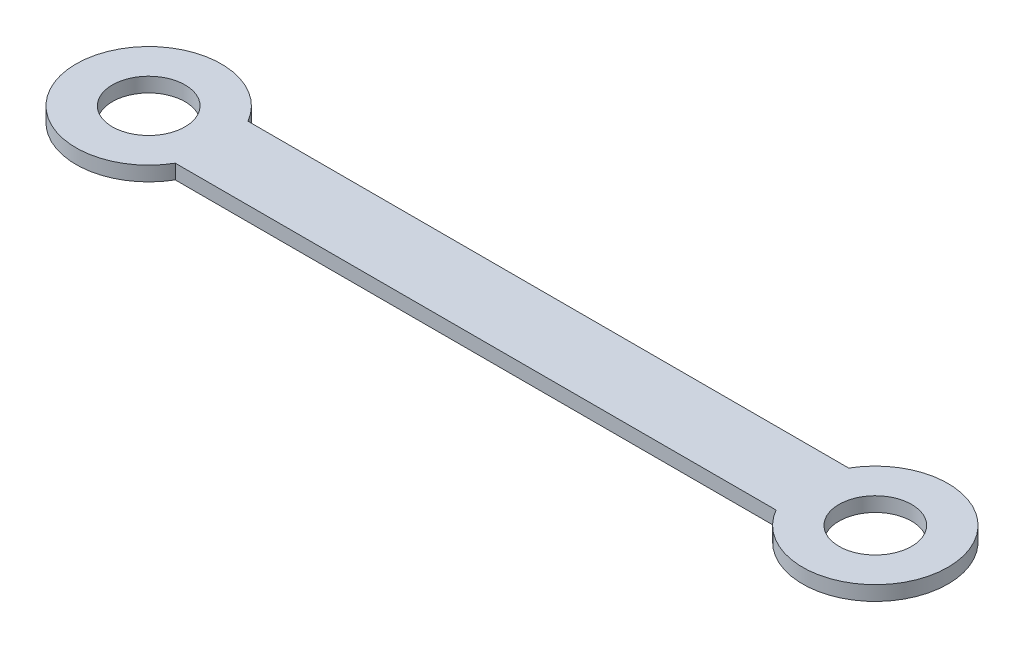
ISO-10303-21;
HEADER;
FILE_DESCRIPTION(('STEP AP214'),'2;1');
FILE_NAME('part.step','',(''),(''),'','','');
FILE_SCHEMA(('AUTOMOTIVE_DESIGN { 1 0 10303 214 1 1 1 1 }'));
ENDSEC;
DATA;
#1=APPLICATION_CONTEXT('core data for automotive mechanical design processes');
#2=APPLICATION_PROTOCOL_DEFINITION('international standard','automotive_design',2000,#1);
#3=PRODUCT_CONTEXT('',#1,'mechanical');
#4=PRODUCT('Part','Part','',(#3));
#5=PRODUCT_RELATED_PRODUCT_CATEGORY('part','',(#4));
#6=PRODUCT_DEFINITION_FORMATION('','',#4);
#7=PRODUCT_DEFINITION_CONTEXT('part definition',#1,'design');
#8=PRODUCT_DEFINITION('design','',#6,#7);
#9=PRODUCT_DEFINITION_SHAPE('','',#8);
#10=(LENGTH_UNIT() NAMED_UNIT(*) SI_UNIT(.MILLI.,.METRE.));
#11=(NAMED_UNIT(*) PLANE_ANGLE_UNIT() SI_UNIT($,.RADIAN.));
#12=(NAMED_UNIT(*) SI_UNIT($,.STERADIAN.) SOLID_ANGLE_UNIT());
#13=UNCERTAINTY_MEASURE_WITH_UNIT(LENGTH_MEASURE(1.E-05),#10,'distance_accuracy_value','');
#14=(GEOMETRIC_REPRESENTATION_CONTEXT(3) GLOBAL_UNCERTAINTY_ASSIGNED_CONTEXT((#13)) GLOBAL_UNIT_ASSIGNED_CONTEXT((#10,
#11,#12)) REPRESENTATION_CONTEXT('',''));
#15=CARTESIAN_POINT('',(0.,0.,0.));
#16=DIRECTION('',(0.,0.,1.));
#17=DIRECTION('',(1.,0.,0.));
#18=AXIS2_PLACEMENT_3D('',#15,#16,#17);
#19=CARTESIAN_POINT('',(100.,2.,0.));
#20=DIRECTION('',(0.,1.,0.));
#21=DIRECTION('',(0.,0.,1.));
#22=AXIS2_PLACEMENT_3D('',#19,#20,#21);
#23=PLANE('',#22);
#24=CARTESIAN_POINT('',(0.,2.,0.));
#25=DIRECTION('',(0.,1.,0.));
#26=DIRECTION('',(0.,0.,1.));
#27=AXIS2_PLACEMENT_3D('',#24,#25,#26);
#28=CIRCLE('',#27,5.);
#29=CARTESIAN_POINT('',(0.,2.,5.));
#30=VERTEX_POINT('',#29);
#31=EDGE_CURVE('E100',#30,#30,#28,.T.);
#32=ORIENTED_EDGE('',*,*,#31,.F.);
#33=EDGE_LOOP('',(#32));
#34=FACE_BOUND('',#33,.T.);
#35=CARTESIAN_POINT('',(100.,2.,0.));
#36=DIRECTION('',(0.,1.,0.));
#37=DIRECTION('',(0.,0.,1.));
#38=AXIS2_PLACEMENT_3D('',#35,#36,#37);
#39=CIRCLE('',#38,10.);
#40=CARTESIAN_POINT('',(91.3397459621556,2.,5.00000000000001));
#41=VERTEX_POINT('',#40);
#42=CARTESIAN_POINT('',(91.3397459621556,2.,-5.00000000000001));
#43=VERTEX_POINT('',#42);
#44=EDGE_CURVE('E85',#41,#43,#39,.T.);
#45=ORIENTED_EDGE('',*,*,#44,.T.);
#46=DIRECTION('',(-1.,0.,0.));
#47=VECTOR('',#46,1.);
#48=CARTESIAN_POINT('',(91.3397459621556,2.,-5.00000000000001));
#49=LINE('',#48,#47);
#50=CARTESIAN_POINT('',(8.6602540378444,2.,-4.99999999999998));
#51=VERTEX_POINT('',#50);
#52=EDGE_CURVE('E80',#43,#51,#49,.T.);
#53=ORIENTED_EDGE('',*,*,#52,.T.);
#54=CARTESIAN_POINT('',(0.,2.,0.));
#55=DIRECTION('',(0.,1.,0.));
#56=DIRECTION('',(0.,0.,1.));
#57=AXIS2_PLACEMENT_3D('',#54,#55,#56);
#58=CIRCLE('',#57,10.);
#59=CARTESIAN_POINT('',(8.6602540378444,2.,4.99999999999998));
#60=VERTEX_POINT('',#59);
#61=EDGE_CURVE('E83',#51,#60,#58,.T.);
#62=ORIENTED_EDGE('',*,*,#61,.T.);
#63=DIRECTION('',(1.,0.,0.));
#64=VECTOR('',#63,1.);
#65=CARTESIAN_POINT('',(8.6602540378444,2.,4.99999999999998));
#66=LINE('',#65,#64);
#67=EDGE_CURVE('E50',#60,#41,#66,.T.);
#68=ORIENTED_EDGE('',*,*,#67,.T.);
#69=EDGE_LOOP('',(#45,#53,#62,#68));
#70=FACE_BOUND('',#69,.T.);
#71=CARTESIAN_POINT('',(100.,2.,0.));
#72=DIRECTION('',(0.,1.,0.));
#73=DIRECTION('',(0.,0.,1.));
#74=AXIS2_PLACEMENT_3D('',#71,#72,#73);
#75=CIRCLE('',#74,4.99999999999999);
#76=CARTESIAN_POINT('',(100.,2.,4.99999999999999));
#77=VERTEX_POINT('',#76);
#78=EDGE_CURVE('E115',#77,#77,#75,.T.);
#79=ORIENTED_EDGE('',*,*,#78,.F.);
#80=EDGE_LOOP('',(#79));
#81=FACE_BOUND('',#80,.T.);
#82=ADVANCED_FACE('F33',(#34,#70,#81),#23,.T.);
#83=CARTESIAN_POINT('',(100.,0.,0.));
#84=DIRECTION('',(0.,1.,0.));
#85=DIRECTION('',(0.,0.,1.));
#86=AXIS2_PLACEMENT_3D('',#83,#84,#85);
#87=PLANE('',#86);
#88=CARTESIAN_POINT('',(100.,0.,0.));
#89=DIRECTION('',(0.,1.,0.));
#90=DIRECTION('',(0.,0.,1.));
#91=AXIS2_PLACEMENT_3D('',#88,#89,#90);
#92=CIRCLE('',#91,10.);
#93=CARTESIAN_POINT('',(91.3397459621556,0.,5.00000000000001));
#94=VERTEX_POINT('',#93);
#95=CARTESIAN_POINT('',(91.3397459621556,0.,-5.00000000000001));
#96=VERTEX_POINT('',#95);
#97=EDGE_CURVE('E97',#94,#96,#92,.T.);
#98=ORIENTED_EDGE('',*,*,#97,.F.);
#99=DIRECTION('',(1.,0.,0.));
#100=VECTOR('',#99,1.);
#101=CARTESIAN_POINT('',(8.6602540378444,0.,4.99999999999998));
#102=LINE('',#101,#100);
#103=CARTESIAN_POINT('',(8.6602540378444,0.,4.99999999999998));
#104=VERTEX_POINT('',#103);
#105=EDGE_CURVE('E73',#104,#94,#102,.T.);
#106=ORIENTED_EDGE('',*,*,#105,.F.);
#107=CARTESIAN_POINT('',(0.,0.,0.));
#108=DIRECTION('',(0.,1.,0.));
#109=DIRECTION('',(0.,0.,1.));
#110=AXIS2_PLACEMENT_3D('',#107,#108,#109);
#111=CIRCLE('',#110,10.);
#112=CARTESIAN_POINT('',(8.6602540378444,0.,-4.99999999999998));
#113=VERTEX_POINT('',#112);
#114=EDGE_CURVE('E67',#113,#104,#111,.T.);
#115=ORIENTED_EDGE('',*,*,#114,.F.);
#116=DIRECTION('',(-1.,0.,0.));
#117=VECTOR('',#116,1.);
#118=CARTESIAN_POINT('',(91.3397459621556,0.,-5.00000000000001));
#119=LINE('',#118,#117);
#120=EDGE_CURVE('E89',#96,#113,#119,.T.);
#121=ORIENTED_EDGE('',*,*,#120,.F.);
#122=EDGE_LOOP('',(#98,#106,#115,#121));
#123=FACE_BOUND('',#122,.T.);
#124=CARTESIAN_POINT('',(0.,0.,0.));
#125=DIRECTION('',(0.,1.,0.));
#126=DIRECTION('',(0.,0.,1.));
#127=AXIS2_PLACEMENT_3D('',#124,#125,#126);
#128=CIRCLE('',#127,5.);
#129=CARTESIAN_POINT('',(0.,0.,5.));
#130=VERTEX_POINT('',#129);
#131=EDGE_CURVE('E112',#130,#130,#128,.T.);
#132=ORIENTED_EDGE('',*,*,#131,.T.);
#133=EDGE_LOOP('',(#132));
#134=FACE_BOUND('',#133,.T.);
#135=CARTESIAN_POINT('',(100.,0.,0.));
#136=DIRECTION('',(0.,1.,0.));
#137=DIRECTION('',(0.,0.,1.));
#138=AXIS2_PLACEMENT_3D('',#135,#136,#137);
#139=CIRCLE('',#138,4.99999999999999);
#140=CARTESIAN_POINT('',(100.,0.,4.99999999999999));
#141=VERTEX_POINT('',#140);
#142=EDGE_CURVE('E118',#141,#141,#139,.T.);
#143=ORIENTED_EDGE('',*,*,#142,.T.);
#144=EDGE_LOOP('',(#143));
#145=FACE_BOUND('',#144,.T.);
#146=ADVANCED_FACE('F108',(#123,#134,#145),#87,.F.);
#147=CARTESIAN_POINT('',(100.,2.,0.));
#148=DIRECTION('',(0.,-1.,0.));
#149=DIRECTION('',(0.,0.,-1.));
#150=AXIS2_PLACEMENT_3D('',#147,#148,#149);
#151=CYLINDRICAL_SURFACE('',#150,10.);
#152=ORIENTED_EDGE('',*,*,#97,.T.);
#153=DIRECTION('',(0.,-1.,0.));
#154=VECTOR('',#153,1.);
#155=CARTESIAN_POINT('',(91.3397459621556,2.,-5.00000000000001));
#156=LINE('',#155,#154);
#157=EDGE_CURVE('E11',#43,#96,#156,.T.);
#158=ORIENTED_EDGE('',*,*,#157,.F.);
#159=ORIENTED_EDGE('',*,*,#44,.F.);
#160=DIRECTION('',(0.,-1.,0.));
#161=VECTOR('',#160,1.);
#162=CARTESIAN_POINT('',(91.3397459621556,2.,5.00000000000001));
#163=LINE('',#162,#161);
#164=EDGE_CURVE('E93',#41,#94,#163,.T.);
#165=ORIENTED_EDGE('',*,*,#164,.T.);
#166=EDGE_LOOP('',(#152,#158,#159,#165));
#167=FACE_BOUND('',#166,.T.);
#168=ADVANCED_FACE('F35',(#167),#151,.T.);
#169=CARTESIAN_POINT('',(91.3397459621556,2.,-5.00000000000001));
#170=DIRECTION('',(0.,0.,1.));
#171=DIRECTION('',(1.,0.,0.));
#172=AXIS2_PLACEMENT_3D('',#169,#170,#171);
#173=PLANE('',#172);
#174=ORIENTED_EDGE('',*,*,#120,.T.);
#175=DIRECTION('',(0.,-1.,0.));
#176=VECTOR('',#175,1.);
#177=CARTESIAN_POINT('',(8.6602540378444,2.,-4.99999999999998));
#178=LINE('',#177,#176);
#179=EDGE_CURVE('E42',#51,#113,#178,.T.);
#180=ORIENTED_EDGE('',*,*,#179,.F.);
#181=ORIENTED_EDGE('',*,*,#52,.F.);
#182=ORIENTED_EDGE('',*,*,#157,.T.);
#183=EDGE_LOOP('',(#174,#180,#181,#182));
#184=FACE_BOUND('',#183,.T.);
#185=ADVANCED_FACE('F88',(#184),#173,.F.);
#186=CARTESIAN_POINT('',(0.,2.,0.));
#187=DIRECTION('',(0.,-1.,0.));
#188=DIRECTION('',(0.,0.,-1.));
#189=AXIS2_PLACEMENT_3D('',#186,#187,#188);
#190=CYLINDRICAL_SURFACE('',#189,10.);
#191=ORIENTED_EDGE('',*,*,#114,.T.);
#192=DIRECTION('',(0.,-1.,0.));
#193=VECTOR('',#192,1.);
#194=CARTESIAN_POINT('',(8.6602540378444,2.,4.99999999999998));
#195=LINE('',#194,#193);
#196=EDGE_CURVE('E90',#60,#104,#195,.T.);
#197=ORIENTED_EDGE('',*,*,#196,.F.);
#198=ORIENTED_EDGE('',*,*,#61,.F.);
#199=ORIENTED_EDGE('',*,*,#179,.T.);
#200=EDGE_LOOP('',(#191,#197,#198,#199));
#201=FACE_BOUND('',#200,.T.);
#202=ADVANCED_FACE('F91',(#201),#190,.T.);
#203=CARTESIAN_POINT('',(8.6602540378444,2.,4.99999999999998));
#204=DIRECTION('',(0.,0.,-1.));
#205=DIRECTION('',(-1.,0.,0.));
#206=AXIS2_PLACEMENT_3D('',#203,#204,#205);
#207=PLANE('',#206);
#208=ORIENTED_EDGE('',*,*,#105,.T.);
#209=ORIENTED_EDGE('',*,*,#164,.F.);
#210=ORIENTED_EDGE('',*,*,#67,.F.);
#211=ORIENTED_EDGE('',*,*,#196,.T.);
#212=EDGE_LOOP('',(#208,#209,#210,#211));
#213=FACE_BOUND('',#212,.T.);
#214=ADVANCED_FACE('F105',(#213),#207,.F.);
#215=CARTESIAN_POINT('',(0.,2.,0.));
#216=DIRECTION('',(0.,-1.,0.));
#217=DIRECTION('',(0.,0.,-1.));
#218=AXIS2_PLACEMENT_3D('',#215,#216,#217);
#219=CYLINDRICAL_SURFACE('',#218,5.);
#220=ORIENTED_EDGE('',*,*,#31,.T.);
#221=EDGE_LOOP('',(#220));
#222=FACE_BOUND('',#221,.T.);
#223=ORIENTED_EDGE('',*,*,#131,.F.);
#224=EDGE_LOOP('',(#223));
#225=FACE_BOUND('',#224,.T.);
#226=ADVANCED_FACE('F135',(#222,#225),#219,.F.);
#227=CARTESIAN_POINT('',(100.,2.,0.));
#228=DIRECTION('',(0.,-1.,0.));
#229=DIRECTION('',(0.,0.,-1.));
#230=AXIS2_PLACEMENT_3D('',#227,#228,#229);
#231=CYLINDRICAL_SURFACE('',#230,4.99999999999999);
#232=ORIENTED_EDGE('',*,*,#78,.T.);
#233=EDGE_LOOP('',(#232));
#234=FACE_BOUND('',#233,.T.);
#235=ORIENTED_EDGE('',*,*,#142,.F.);
#236=EDGE_LOOP('',(#235));
#237=FACE_BOUND('',#236,.T.);
#238=ADVANCED_FACE('F124',(#234,#237),#231,.F.);
#239=CLOSED_SHELL('',(#82,#146,#168,#185,#202,#214,#226,#238));
#240=MANIFOLD_SOLID_BREP('B2',#239);
#241=ADVANCED_BREP_SHAPE_REPRESENTATION('',(#18,#240),#14);
#242=SHAPE_DEFINITION_REPRESENTATION(#9,#241);
ENDSEC;
END-ISO-10303-21;
